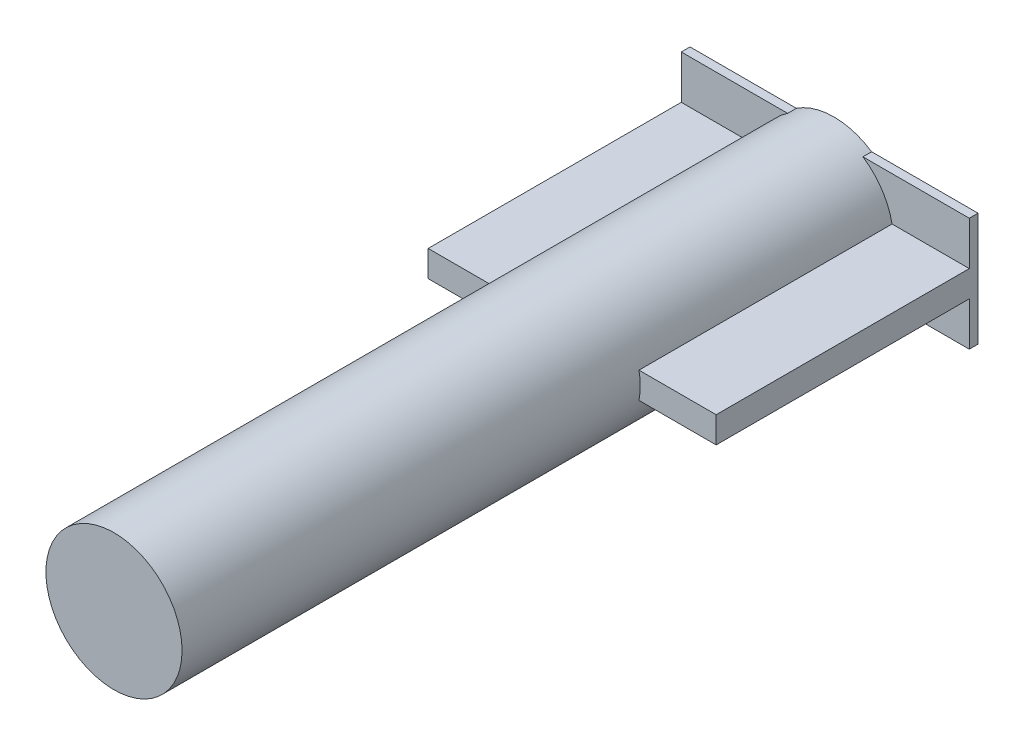
ISO-10303-21;
HEADER;
FILE_DESCRIPTION(('STEP AP214'),'2;1');
FILE_NAME('part.step','',(''),(''),'','','');
FILE_SCHEMA(('AUTOMOTIVE_DESIGN { 1 0 10303 214 1 1 1 1 }'));
ENDSEC;
DATA;
#1=APPLICATION_CONTEXT('core data for automotive mechanical design processes');
#2=APPLICATION_PROTOCOL_DEFINITION('international standard','automotive_design',2000,#1);
#3=PRODUCT_CONTEXT('',#1,'mechanical');
#4=PRODUCT('Part','Part','',(#3));
#5=PRODUCT_RELATED_PRODUCT_CATEGORY('part','',(#4));
#6=PRODUCT_DEFINITION_FORMATION('','',#4);
#7=PRODUCT_DEFINITION_CONTEXT('part definition',#1,'design');
#8=PRODUCT_DEFINITION('design','',#6,#7);
#9=PRODUCT_DEFINITION_SHAPE('','',#8);
#10=(LENGTH_UNIT() NAMED_UNIT(*) SI_UNIT(.MILLI.,.METRE.));
#11=(NAMED_UNIT(*) PLANE_ANGLE_UNIT() SI_UNIT($,.RADIAN.));
#12=(NAMED_UNIT(*) SI_UNIT($,.STERADIAN.) SOLID_ANGLE_UNIT());
#13=UNCERTAINTY_MEASURE_WITH_UNIT(LENGTH_MEASURE(1.E-05),#10,'distance_accuracy_value','');
#14=(GEOMETRIC_REPRESENTATION_CONTEXT(3) GLOBAL_UNCERTAINTY_ASSIGNED_CONTEXT((#13)) GLOBAL_UNIT_ASSIGNED_CONTEXT((#10,
#11,#12)) REPRESENTATION_CONTEXT('',''));
#15=CARTESIAN_POINT('',(0.,0.,0.));
#16=DIRECTION('',(0.,0.,1.));
#17=DIRECTION('',(1.,0.,0.));
#18=AXIS2_PLACEMENT_3D('',#15,#16,#17);
#19=CARTESIAN_POINT('',(0.,0.,1.));
#20=DIRECTION('',(0.,0.,-1.));
#21=DIRECTION('',(-1.,0.,0.));
#22=AXIS2_PLACEMENT_3D('',#19,#20,#21);
#23=PLANE('',#22);
#24=CARTESIAN_POINT('',(0.,0.,1.));
#25=DIRECTION('',(0.,0.,-1.));
#26=DIRECTION('',(-1.,0.,0.));
#27=AXIS2_PLACEMENT_3D('',#24,#25,#26);
#28=CIRCLE('',#27,7.8);
#29=CARTESIAN_POINT('',(-4.31161222746202,-6.5,1.));
#30=VERTEX_POINT('',#29);
#31=CARTESIAN_POINT('',(-7.65441049330384,-1.5,1.));
#32=VERTEX_POINT('',#31);
#33=EDGE_CURVE('E255',#30,#32,#28,.T.);
#34=ORIENTED_EDGE('',*,*,#33,.T.);
#35=DIRECTION('',(-1.,0.,0.));
#36=VECTOR('',#35,1.);
#37=CARTESIAN_POINT('',(0.,-1.5,1.));
#38=LINE('',#37,#36);
#39=CARTESIAN_POINT('',(-16.5,-1.5,1.));
#40=VERTEX_POINT('',#39);
#41=EDGE_CURVE('E193',#32,#40,#38,.T.);
#42=ORIENTED_EDGE('',*,*,#41,.T.);
#43=DIRECTION('',(0.,1.,0.));
#44=VECTOR('',#43,1.);
#45=CARTESIAN_POINT('',(-16.5,6.5,1.));
#46=LINE('',#45,#44);
#47=CARTESIAN_POINT('',(-16.5,-6.5,1.));
#48=VERTEX_POINT('',#47);
#49=EDGE_CURVE('E200',#48,#40,#46,.T.);
#50=ORIENTED_EDGE('',*,*,#49,.F.);
#51=DIRECTION('',(-1.,0.,0.));
#52=VECTOR('',#51,1.);
#53=CARTESIAN_POINT('',(16.5,-6.5,1.));
#54=LINE('',#53,#52);
#55=EDGE_CURVE('E211',#30,#48,#54,.T.);
#56=ORIENTED_EDGE('',*,*,#55,.F.);
#57=EDGE_LOOP('',(#34,#42,#50,#56));
#58=FACE_BOUND('',#57,.T.);
#59=ADVANCED_FACE('F33',(#58),#23,.F.);
#60=DIRECTION('',(0.,-1.,0.));
#61=VECTOR('',#60,1.);
#62=CARTESIAN_POINT('',(16.5,6.5,1.));
#63=LINE('',#62,#61);
#64=CARTESIAN_POINT('',(16.5,-1.5,1.));
#65=VERTEX_POINT('',#64);
#66=CARTESIAN_POINT('',(16.5,-6.5,1.));
#67=VERTEX_POINT('',#66);
#68=EDGE_CURVE('E207',#65,#67,#63,.T.);
#69=ORIENTED_EDGE('',*,*,#68,.F.);
#70=DIRECTION('',(-1.,0.,0.));
#71=VECTOR('',#70,1.);
#72=CARTESIAN_POINT('',(0.,-1.5,1.));
#73=LINE('',#72,#71);
#74=CARTESIAN_POINT('',(7.65441049330384,-1.5,1.));
#75=VERTEX_POINT('',#74);
#76=EDGE_CURVE('E187',#65,#75,#73,.T.);
#77=ORIENTED_EDGE('',*,*,#76,.T.);
#78=CARTESIAN_POINT('',(4.31161222746202,-6.5,1.));
#79=VERTEX_POINT('',#78);
#80=EDGE_CURVE('E257',#75,#79,#28,.T.);
#81=ORIENTED_EDGE('',*,*,#80,.T.);
#82=EDGE_CURVE('E212',#67,#79,#54,.T.);
#83=ORIENTED_EDGE('',*,*,#82,.F.);
#84=EDGE_LOOP('',(#69,#77,#81,#83));
#85=FACE_BOUND('',#84,.T.);
#86=ADVANCED_FACE('F304',(#85),#23,.F.);
#87=CARTESIAN_POINT('',(0.,0.,82.5));
#88=DIRECTION('',(0.,0.,-1.));
#89=DIRECTION('',(-1.,0.,0.));
#90=AXIS2_PLACEMENT_3D('',#87,#88,#89);
#91=CYLINDRICAL_SURFACE('',#90,7.8);
#92=ORIENTED_EDGE('',*,*,#80,.F.);
#93=DIRECTION('',(0.,0.,-1.));
#94=VECTOR('',#93,1.);
#95=CARTESIAN_POINT('',(7.65441049330384,-1.5,82.5));
#96=LINE('',#95,#94);
#97=CARTESIAN_POINT('',(7.65441049330384,-1.5,30.));
#98=VERTEX_POINT('',#97);
#99=EDGE_CURVE('E190',#75,#98,#96,.F.);
#100=ORIENTED_EDGE('',*,*,#99,.T.);
#101=CARTESIAN_POINT('',(0.,0.,30.));
#102=DIRECTION('',(0.,0.,-1.));
#103=DIRECTION('',(-1.,0.,0.));
#104=AXIS2_PLACEMENT_3D('',#101,#102,#103);
#105=CIRCLE('',#104,7.8);
#106=CARTESIAN_POINT('',(7.65441049330384,1.5,30.));
#107=VERTEX_POINT('',#106);
#108=EDGE_CURVE('E11',#107,#98,#105,.T.);
#109=ORIENTED_EDGE('',*,*,#108,.F.);
#110=DIRECTION('',(0.,0.,-1.));
#111=VECTOR('',#110,1.);
#112=CARTESIAN_POINT('',(7.65441049330384,1.5,82.5));
#113=LINE('',#112,#111);
#114=CARTESIAN_POINT('',(7.65441049330384,1.5,1.));
#115=VERTEX_POINT('',#114);
#116=EDGE_CURVE('E182',#107,#115,#113,.T.);
#117=ORIENTED_EDGE('',*,*,#116,.T.);
#118=CARTESIAN_POINT('',(4.31161222746202,6.5,1.));
#119=VERTEX_POINT('',#118);
#120=EDGE_CURVE('E258',#119,#115,#28,.T.);
#121=ORIENTED_EDGE('',*,*,#120,.F.);
#122=DIRECTION('',(0.,0.,-1.));
#123=VECTOR('',#122,1.);
#124=CARTESIAN_POINT('',(4.31161222746202,6.5,82.5));
#125=LINE('',#124,#123);
#126=CARTESIAN_POINT('',(4.31161222746202,6.5,0.));
#127=VERTEX_POINT('',#126);
#128=EDGE_CURVE('E240',#119,#127,#125,.T.);
#129=ORIENTED_EDGE('',*,*,#128,.T.);
#130=CARTESIAN_POINT('',(0.,0.,0.));
#131=DIRECTION('',(0.,0.,1.));
#132=DIRECTION('',(1.,0.,0.));
#133=AXIS2_PLACEMENT_3D('',#130,#131,#132);
#134=CIRCLE('',#133,7.8);
#135=CARTESIAN_POINT('',(-4.31161222746202,6.5,0.));
#136=VERTEX_POINT('',#135);
#137=EDGE_CURVE('E254',#127,#136,#134,.T.);
#138=ORIENTED_EDGE('',*,*,#137,.T.);
#139=DIRECTION('',(0.,0.,-1.));
#140=VECTOR('',#139,1.);
#141=CARTESIAN_POINT('',(-4.31161222746202,6.5,82.5));
#142=LINE('',#141,#140);
#143=CARTESIAN_POINT('',(-4.31161222746202,6.5,1.));
#144=VERTEX_POINT('',#143);
#145=EDGE_CURVE('E230',#136,#144,#142,.F.);
#146=ORIENTED_EDGE('',*,*,#145,.T.);
#147=CARTESIAN_POINT('',(-7.65441049330384,1.5,1.));
#148=VERTEX_POINT('',#147);
#149=EDGE_CURVE('E253',#148,#144,#28,.T.);
#150=ORIENTED_EDGE('',*,*,#149,.F.);
#151=DIRECTION('',(0.,0.,-1.));
#152=VECTOR('',#151,1.);
#153=CARTESIAN_POINT('',(-7.65441049330384,1.5,82.5));
#154=LINE('',#153,#152);
#155=CARTESIAN_POINT('',(-7.65441049330384,1.5,30.));
#156=VERTEX_POINT('',#155);
#157=EDGE_CURVE('E48',#148,#156,#154,.F.);
#158=ORIENTED_EDGE('',*,*,#157,.T.);
#159=CARTESIAN_POINT('',(-7.65441049330384,-1.5,30.));
#160=VERTEX_POINT('',#159);
#161=EDGE_CURVE('E37',#160,#156,#105,.T.);
#162=ORIENTED_EDGE('',*,*,#161,.F.);
#163=DIRECTION('',(0.,0.,-1.));
#164=VECTOR('',#163,1.);
#165=CARTESIAN_POINT('',(-7.65441049330384,-1.5,82.5));
#166=LINE('',#165,#164);
#167=EDGE_CURVE('E196',#160,#32,#166,.T.);
#168=ORIENTED_EDGE('',*,*,#167,.T.);
#169=ORIENTED_EDGE('',*,*,#33,.F.);
#170=DIRECTION('',(0.,0.,-1.));
#171=VECTOR('',#170,1.);
#172=CARTESIAN_POINT('',(-4.31161222746202,-6.5,82.5));
#173=LINE('',#172,#171);
#174=CARTESIAN_POINT('',(-4.31161222746202,-6.5,0.));
#175=VERTEX_POINT('',#174);
#176=EDGE_CURVE('E246',#30,#175,#173,.T.);
#177=ORIENTED_EDGE('',*,*,#176,.T.);
#178=CARTESIAN_POINT('',(4.31161222746202,-6.5,0.));
#179=VERTEX_POINT('',#178);
#180=EDGE_CURVE('E249',#175,#179,#134,.T.);
#181=ORIENTED_EDGE('',*,*,#180,.T.);
#182=DIRECTION('',(0.,0.,-1.));
#183=VECTOR('',#182,1.);
#184=CARTESIAN_POINT('',(4.31161222746202,-6.5,82.5));
#185=LINE('',#184,#183);
#186=EDGE_CURVE('E243',#179,#79,#185,.F.);
#187=ORIENTED_EDGE('',*,*,#186,.T.);
#188=EDGE_LOOP('',(#92,#100,#109,#117,#121,#129,#138,#146,#150,#158,#162,#168,#169,#177,#181,#187));
#189=FACE_BOUND('',#188,.T.);
#190=CARTESIAN_POINT('',(0.,0.,82.5));
#191=DIRECTION('',(0.,0.,1.));
#192=DIRECTION('',(1.,0.,0.));
#193=AXIS2_PLACEMENT_3D('',#190,#191,#192);
#194=CIRCLE('',#193,7.8);
#195=CARTESIAN_POINT('',(7.8,0.,82.5));
#196=VERTEX_POINT('',#195);
#197=EDGE_CURVE('E250',#196,#196,#194,.T.);
#198=ORIENTED_EDGE('',*,*,#197,.F.);
#199=EDGE_LOOP('',(#198));
#200=FACE_BOUND('',#199,.T.);
#201=ADVANCED_FACE('F35',(#189,#200),#91,.T.);
#202=CARTESIAN_POINT('',(0.,0.,82.5));
#203=DIRECTION('',(0.,0.,1.));
#204=DIRECTION('',(1.,0.,0.));
#205=AXIS2_PLACEMENT_3D('',#202,#203,#204);
#206=PLANE('',#205);
#207=ORIENTED_EDGE('',*,*,#197,.T.);
#208=EDGE_LOOP('',(#207));
#209=FACE_BOUND('',#208,.T.);
#210=ADVANCED_FACE('F353',(#209),#206,.T.);
#211=CARTESIAN_POINT('',(0.,0.,0.));
#212=DIRECTION('',(0.,0.,1.));
#213=DIRECTION('',(1.,0.,0.));
#214=AXIS2_PLACEMENT_3D('',#211,#212,#213);
#215=PLANE('',#214);
#216=DIRECTION('',(0.,-1.,0.));
#217=VECTOR('',#216,1.);
#218=CARTESIAN_POINT('',(16.5,6.5,0.));
#219=LINE('',#218,#217);
#220=CARTESIAN_POINT('',(16.5,6.5,0.));
#221=VERTEX_POINT('',#220);
#222=CARTESIAN_POINT('',(16.5,-6.5,0.));
#223=VERTEX_POINT('',#222);
#224=EDGE_CURVE('E221',#221,#223,#219,.T.);
#225=ORIENTED_EDGE('',*,*,#224,.T.);
#226=DIRECTION('',(-1.,0.,0.));
#227=VECTOR('',#226,1.);
#228=CARTESIAN_POINT('',(16.5,-6.5,0.));
#229=LINE('',#228,#227);
#230=EDGE_CURVE('E224',#223,#179,#229,.T.);
#231=ORIENTED_EDGE('',*,*,#230,.T.);
#232=ORIENTED_EDGE('',*,*,#180,.F.);
#233=CARTESIAN_POINT('',(-16.5,-6.5,0.));
#234=VERTEX_POINT('',#233);
#235=EDGE_CURVE('E223',#175,#234,#229,.T.);
#236=ORIENTED_EDGE('',*,*,#235,.T.);
#237=DIRECTION('',(0.,1.,0.));
#238=VECTOR('',#237,1.);
#239=CARTESIAN_POINT('',(-16.5,6.5,0.));
#240=LINE('',#239,#238);
#241=CARTESIAN_POINT('',(-16.5,6.5,0.));
#242=VERTEX_POINT('',#241);
#243=EDGE_CURVE('E199',#234,#242,#240,.T.);
#244=ORIENTED_EDGE('',*,*,#243,.T.);
#245=DIRECTION('',(1.,0.,0.));
#246=VECTOR('',#245,1.);
#247=CARTESIAN_POINT('',(16.5,6.5,0.));
#248=LINE('',#247,#246);
#249=EDGE_CURVE('E218',#242,#136,#248,.T.);
#250=ORIENTED_EDGE('',*,*,#249,.T.);
#251=ORIENTED_EDGE('',*,*,#137,.F.);
#252=EDGE_CURVE('E217',#127,#221,#248,.T.);
#253=ORIENTED_EDGE('',*,*,#252,.T.);
#254=EDGE_LOOP('',(#225,#231,#232,#236,#244,#250,#251,#253));
#255=FACE_BOUND('',#254,.T.);
#256=ADVANCED_FACE('F277',(#255),#215,.F.);
#257=CARTESIAN_POINT('',(-16.5,6.5,1.));
#258=DIRECTION('',(-1.,0.,0.));
#259=DIRECTION('',(0.,0.,1.));
#260=AXIS2_PLACEMENT_3D('',#257,#258,#259);
#261=PLANE('',#260);
#262=DIRECTION('',(0.,0.,-1.));
#263=VECTOR('',#262,1.);
#264=CARTESIAN_POINT('',(-16.5,6.5,1.));
#265=LINE('',#264,#263);
#266=CARTESIAN_POINT('',(-16.5,6.5,1.));
#267=VERTEX_POINT('',#266);
#268=EDGE_CURVE('E215',#267,#242,#265,.T.);
#269=ORIENTED_EDGE('',*,*,#268,.T.);
#270=ORIENTED_EDGE('',*,*,#243,.F.);
#271=DIRECTION('',(0.,0.,-1.));
#272=VECTOR('',#271,1.);
#273=CARTESIAN_POINT('',(-16.5,-6.5,1.));
#274=LINE('',#273,#272);
#275=EDGE_CURVE('E227',#48,#234,#274,.T.);
#276=ORIENTED_EDGE('',*,*,#275,.F.);
#277=ORIENTED_EDGE('',*,*,#49,.T.);
#278=DIRECTION('',(0.,0.,-1.));
#279=VECTOR('',#278,1.);
#280=CARTESIAN_POINT('',(-16.5,-1.5,30.));
#281=LINE('',#280,#279);
#282=CARTESIAN_POINT('',(-16.5,-1.5,30.));
#283=VERTEX_POINT('',#282);
#284=EDGE_CURVE('E167',#283,#40,#281,.T.);
#285=ORIENTED_EDGE('',*,*,#284,.F.);
#286=DIRECTION('',(0.,1.,0.));
#287=VECTOR('',#286,1.);
#288=CARTESIAN_POINT('',(-16.5,1.5,30.));
#289=LINE('',#288,#287);
#290=CARTESIAN_POINT('',(-16.5,1.5,30.));
#291=VERTEX_POINT('',#290);
#292=EDGE_CURVE('E158',#283,#291,#289,.T.);
#293=ORIENTED_EDGE('',*,*,#292,.T.);
#294=DIRECTION('',(0.,0.,-1.));
#295=VECTOR('',#294,1.);
#296=CARTESIAN_POINT('',(-16.5,1.5,30.));
#297=LINE('',#296,#295);
#298=CARTESIAN_POINT('',(-16.5,1.5,1.));
#299=VERTEX_POINT('',#298);
#300=EDGE_CURVE('E144',#291,#299,#297,.T.);
#301=ORIENTED_EDGE('',*,*,#300,.T.);
#302=EDGE_CURVE('E203',#299,#267,#46,.T.);
#303=ORIENTED_EDGE('',*,*,#302,.T.);
#304=EDGE_LOOP('',(#269,#270,#276,#277,#285,#293,#301,#303));
#305=FACE_BOUND('',#304,.T.);
#306=ADVANCED_FACE('F165',(#305),#261,.T.);
#307=ORIENTED_EDGE('',*,*,#302,.F.);
#308=DIRECTION('',(1.,0.,0.));
#309=VECTOR('',#308,1.);
#310=CARTESIAN_POINT('',(0.,1.5,1.));
#311=LINE('',#310,#309);
#312=EDGE_CURVE('E148',#299,#148,#311,.T.);
#313=ORIENTED_EDGE('',*,*,#312,.T.);
#314=ORIENTED_EDGE('',*,*,#149,.T.);
#315=DIRECTION('',(1.,0.,0.));
#316=VECTOR('',#315,1.);
#317=CARTESIAN_POINT('',(16.5,6.5,1.));
#318=LINE('',#317,#316);
#319=EDGE_CURVE('E204',#267,#144,#318,.T.);
#320=ORIENTED_EDGE('',*,*,#319,.F.);
#321=EDGE_LOOP('',(#307,#313,#314,#320));
#322=FACE_BOUND('',#321,.T.);
#323=ADVANCED_FACE('F286',(#322),#23,.F.);
#324=CARTESIAN_POINT('',(16.5,6.5,1.));
#325=DIRECTION('',(0.,1.,0.));
#326=DIRECTION('',(0.,0.,1.));
#327=AXIS2_PLACEMENT_3D('',#324,#325,#326);
#328=PLANE('',#327);
#329=ORIENTED_EDGE('',*,*,#145,.F.);
#330=ORIENTED_EDGE('',*,*,#249,.F.);
#331=ORIENTED_EDGE('',*,*,#268,.F.);
#332=ORIENTED_EDGE('',*,*,#319,.T.);
#333=EDGE_LOOP('',(#329,#330,#331,#332));
#334=FACE_BOUND('',#333,.T.);
#335=ADVANCED_FACE('F282',(#334),#328,.T.);
#336=CARTESIAN_POINT('',(16.5,-6.5,1.));
#337=DIRECTION('',(0.,-1.,0.));
#338=DIRECTION('',(0.,0.,-1.));
#339=AXIS2_PLACEMENT_3D('',#336,#337,#338);
#340=PLANE('',#339);
#341=ORIENTED_EDGE('',*,*,#176,.F.);
#342=ORIENTED_EDGE('',*,*,#55,.T.);
#343=ORIENTED_EDGE('',*,*,#275,.T.);
#344=ORIENTED_EDGE('',*,*,#235,.F.);
#345=EDGE_LOOP('',(#341,#342,#343,#344));
#346=FACE_BOUND('',#345,.T.);
#347=ADVANCED_FACE('F295',(#346),#340,.T.);
#348=ORIENTED_EDGE('',*,*,#120,.T.);
#349=DIRECTION('',(1.,0.,0.));
#350=VECTOR('',#349,1.);
#351=CARTESIAN_POINT('',(0.,1.5,1.));
#352=LINE('',#351,#350);
#353=CARTESIAN_POINT('',(16.5,1.5,1.));
#354=VERTEX_POINT('',#353);
#355=EDGE_CURVE('E176',#115,#354,#352,.T.);
#356=ORIENTED_EDGE('',*,*,#355,.T.);
#357=CARTESIAN_POINT('',(16.5,6.5,1.));
#358=VERTEX_POINT('',#357);
#359=EDGE_CURVE('E208',#358,#354,#63,.T.);
#360=ORIENTED_EDGE('',*,*,#359,.F.);
#361=EDGE_CURVE('E202',#119,#358,#318,.T.);
#362=ORIENTED_EDGE('',*,*,#361,.F.);
#363=EDGE_LOOP('',(#348,#356,#360,#362));
#364=FACE_BOUND('',#363,.T.);
#365=ADVANCED_FACE('F264',(#364),#23,.F.);
#366=ORIENTED_EDGE('',*,*,#186,.F.);
#367=ORIENTED_EDGE('',*,*,#230,.F.);
#368=DIRECTION('',(0.,0.,-1.));
#369=VECTOR('',#368,1.);
#370=CARTESIAN_POINT('',(16.5,-6.5,1.));
#371=LINE('',#370,#369);
#372=EDGE_CURVE('E231',#67,#223,#371,.T.);
#373=ORIENTED_EDGE('',*,*,#372,.F.);
#374=ORIENTED_EDGE('',*,*,#82,.T.);
#375=EDGE_LOOP('',(#366,#367,#373,#374));
#376=FACE_BOUND('',#375,.T.);
#377=ADVANCED_FACE('F299',(#376),#340,.T.);
#378=ORIENTED_EDGE('',*,*,#128,.F.);
#379=ORIENTED_EDGE('',*,*,#361,.T.);
#380=DIRECTION('',(0.,0.,-1.));
#381=VECTOR('',#380,1.);
#382=CARTESIAN_POINT('',(16.5,6.5,1.));
#383=LINE('',#382,#381);
#384=EDGE_CURVE('E234',#358,#221,#383,.T.);
#385=ORIENTED_EDGE('',*,*,#384,.T.);
#386=ORIENTED_EDGE('',*,*,#252,.F.);
#387=EDGE_LOOP('',(#378,#379,#385,#386));
#388=FACE_BOUND('',#387,.T.);
#389=ADVANCED_FACE('F273',(#388),#328,.T.);
#390=CARTESIAN_POINT('',(16.5,6.5,1.));
#391=DIRECTION('',(1.,0.,0.));
#392=DIRECTION('',(0.,0.,-1.));
#393=AXIS2_PLACEMENT_3D('',#390,#391,#392);
#394=PLANE('',#393);
#395=ORIENTED_EDGE('',*,*,#359,.T.);
#396=DIRECTION('',(0.,0.,-1.));
#397=VECTOR('',#396,1.);
#398=CARTESIAN_POINT('',(16.5,1.5,30.));
#399=LINE('',#398,#397);
#400=CARTESIAN_POINT('',(16.5,1.5,30.));
#401=VERTEX_POINT('',#400);
#402=EDGE_CURVE('E56',#401,#354,#399,.T.);
#403=ORIENTED_EDGE('',*,*,#402,.F.);
#404=DIRECTION('',(0.,-1.,0.));
#405=VECTOR('',#404,1.);
#406=CARTESIAN_POINT('',(16.5,1.5,30.));
#407=LINE('',#406,#405);
#408=CARTESIAN_POINT('',(16.5,-1.5,30.));
#409=VERTEX_POINT('',#408);
#410=EDGE_CURVE('E160',#401,#409,#407,.T.);
#411=ORIENTED_EDGE('',*,*,#410,.T.);
#412=DIRECTION('',(0.,0.,-1.));
#413=VECTOR('',#412,1.);
#414=CARTESIAN_POINT('',(16.5,-1.5,30.));
#415=LINE('',#414,#413);
#416=EDGE_CURVE('E177',#409,#65,#415,.T.);
#417=ORIENTED_EDGE('',*,*,#416,.T.);
#418=ORIENTED_EDGE('',*,*,#68,.T.);
#419=ORIENTED_EDGE('',*,*,#372,.T.);
#420=ORIENTED_EDGE('',*,*,#224,.F.);
#421=ORIENTED_EDGE('',*,*,#384,.F.);
#422=EDGE_LOOP('',(#395,#403,#411,#417,#418,#419,#420,#421));
#423=FACE_BOUND('',#422,.T.);
#424=ADVANCED_FACE('F314',(#423),#394,.T.);
#425=CARTESIAN_POINT('',(16.5,1.5,30.));
#426=DIRECTION('',(0.,1.,0.));
#427=DIRECTION('',(0.,0.,1.));
#428=AXIS2_PLACEMENT_3D('',#425,#426,#427);
#429=PLANE('',#428);
#430=ORIENTED_EDGE('',*,*,#116,.F.);
#431=DIRECTION('',(1.,0.,0.));
#432=VECTOR('',#431,1.);
#433=CARTESIAN_POINT('',(16.5,1.5,30.));
#434=LINE('',#433,#432);
#435=EDGE_CURVE('E161',#107,#401,#434,.T.);
#436=ORIENTED_EDGE('',*,*,#435,.T.);
#437=ORIENTED_EDGE('',*,*,#402,.T.);
#438=ORIENTED_EDGE('',*,*,#355,.F.);
#439=EDGE_LOOP('',(#430,#436,#437,#438));
#440=FACE_BOUND('',#439,.T.);
#441=ADVANCED_FACE('F312',(#440),#429,.T.);
#442=CARTESIAN_POINT('',(16.5,-1.5,30.));
#443=DIRECTION('',(0.,-1.,0.));
#444=DIRECTION('',(0.,0.,-1.));
#445=AXIS2_PLACEMENT_3D('',#442,#443,#444);
#446=PLANE('',#445);
#447=ORIENTED_EDGE('',*,*,#99,.F.);
#448=ORIENTED_EDGE('',*,*,#76,.F.);
#449=ORIENTED_EDGE('',*,*,#416,.F.);
#450=DIRECTION('',(-1.,0.,0.));
#451=VECTOR('',#450,1.);
#452=CARTESIAN_POINT('',(16.5,-1.5,30.));
#453=LINE('',#452,#451);
#454=EDGE_CURVE('E152',#409,#98,#453,.T.);
#455=ORIENTED_EDGE('',*,*,#454,.T.);
#456=EDGE_LOOP('',(#447,#448,#449,#455));
#457=FACE_BOUND('',#456,.T.);
#458=ADVANCED_FACE('F306',(#457),#446,.T.);
#459=CARTESIAN_POINT('',(0.,0.,30.));
#460=DIRECTION('',(0.,0.,-1.));
#461=DIRECTION('',(-1.,0.,0.));
#462=AXIS2_PLACEMENT_3D('',#459,#460,#461);
#463=PLANE('',#462);
#464=ORIENTED_EDGE('',*,*,#435,.F.);
#465=ORIENTED_EDGE('',*,*,#108,.T.);
#466=ORIENTED_EDGE('',*,*,#454,.F.);
#467=ORIENTED_EDGE('',*,*,#410,.F.);
#468=EDGE_LOOP('',(#464,#465,#466,#467));
#469=FACE_BOUND('',#468,.T.);
#470=ADVANCED_FACE('F311',(#469),#463,.F.);
#471=ORIENTED_EDGE('',*,*,#167,.F.);
#472=EDGE_CURVE('E172',#160,#283,#453,.T.);
#473=ORIENTED_EDGE('',*,*,#472,.T.);
#474=ORIENTED_EDGE('',*,*,#284,.T.);
#475=ORIENTED_EDGE('',*,*,#41,.F.);
#476=EDGE_LOOP('',(#471,#473,#474,#475));
#477=FACE_BOUND('',#476,.T.);
#478=ADVANCED_FACE('F289',(#477),#446,.T.);
#479=ORIENTED_EDGE('',*,*,#157,.F.);
#480=ORIENTED_EDGE('',*,*,#312,.F.);
#481=ORIENTED_EDGE('',*,*,#300,.F.);
#482=EDGE_CURVE('E147',#291,#156,#434,.T.);
#483=ORIENTED_EDGE('',*,*,#482,.T.);
#484=EDGE_LOOP('',(#479,#480,#481,#483));
#485=FACE_BOUND('',#484,.T.);
#486=ADVANCED_FACE('F146',(#485),#429,.T.);
#487=ORIENTED_EDGE('',*,*,#472,.F.);
#488=ORIENTED_EDGE('',*,*,#161,.T.);
#489=ORIENTED_EDGE('',*,*,#482,.F.);
#490=ORIENTED_EDGE('',*,*,#292,.F.);
#491=EDGE_LOOP('',(#487,#488,#489,#490));
#492=FACE_BOUND('',#491,.T.);
#493=ADVANCED_FACE('F157',(#492),#463,.F.);
#494=CLOSED_SHELL('',(#59,#86,#201,#210,#256,#306,#323,#335,#347,#365,#377,#389,#424,#441,#458,
#470,#478,#486,#493));
#495=MANIFOLD_SOLID_BREP('B2',#494);
#496=ADVANCED_BREP_SHAPE_REPRESENTATION('',(#18,#495),#14);
#497=SHAPE_DEFINITION_REPRESENTATION(#9,#496);
ENDSEC;
END-ISO-10303-21;
